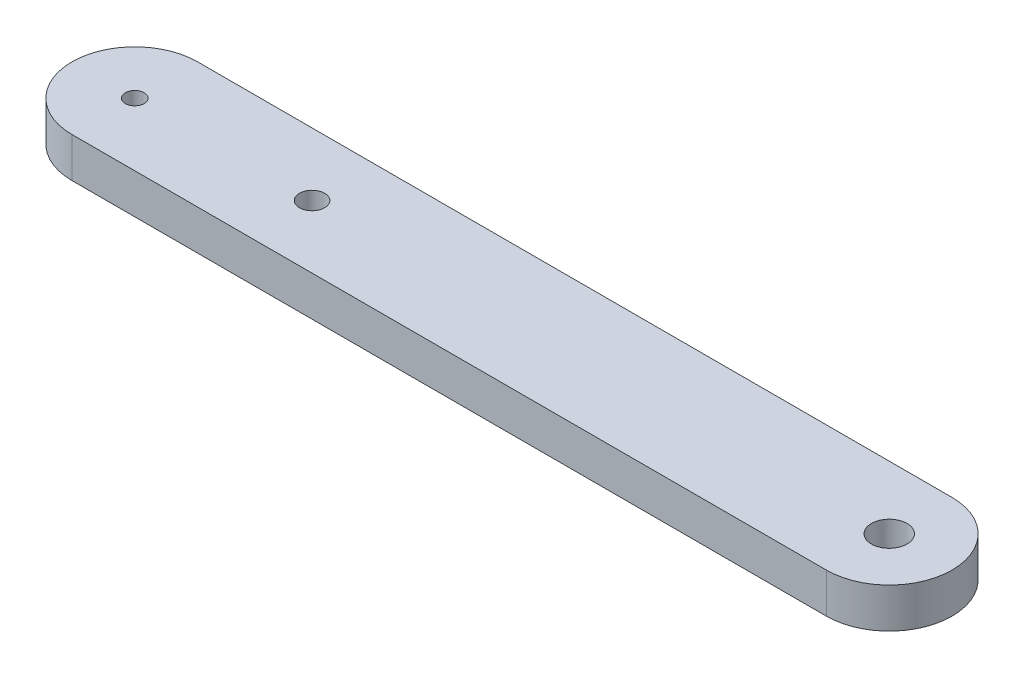
ISO-10303-21;
HEADER;
FILE_DESCRIPTION(('STEP AP214'),'2;1');
FILE_NAME('part.step','',(''),(''),'','','');
FILE_SCHEMA(('AUTOMOTIVE_DESIGN { 1 0 10303 214 1 1 1 1 }'));
ENDSEC;
DATA;
#1=APPLICATION_CONTEXT('core data for automotive mechanical design processes');
#2=APPLICATION_PROTOCOL_DEFINITION('international standard','automotive_design',2000,#1);
#3=PRODUCT_CONTEXT('',#1,'mechanical');
#4=PRODUCT('Part','Part','',(#3));
#5=PRODUCT_RELATED_PRODUCT_CATEGORY('part','',(#4));
#6=PRODUCT_DEFINITION_FORMATION('','',#4);
#7=PRODUCT_DEFINITION_CONTEXT('part definition',#1,'design');
#8=PRODUCT_DEFINITION('design','',#6,#7);
#9=PRODUCT_DEFINITION_SHAPE('','',#8);
#10=(LENGTH_UNIT() NAMED_UNIT(*) SI_UNIT(.MILLI.,.METRE.));
#11=(NAMED_UNIT(*) PLANE_ANGLE_UNIT() SI_UNIT($,.RADIAN.));
#12=(NAMED_UNIT(*) SI_UNIT($,.STERADIAN.) SOLID_ANGLE_UNIT());
#13=UNCERTAINTY_MEASURE_WITH_UNIT(LENGTH_MEASURE(1.E-05),#10,'distance_accuracy_value','');
#14=(GEOMETRIC_REPRESENTATION_CONTEXT(3) GLOBAL_UNCERTAINTY_ASSIGNED_CONTEXT((#13)) GLOBAL_UNIT_ASSIGNED_CONTEXT((#10,
#11,#12)) REPRESENTATION_CONTEXT('',''));
#15=CARTESIAN_POINT('',(0.,0.,0.));
#16=DIRECTION('',(0.,0.,1.));
#17=DIRECTION('',(1.,0.,0.));
#18=AXIS2_PLACEMENT_3D('',#15,#16,#17);
#19=CARTESIAN_POINT('',(30.,3.175,0.));
#20=DIRECTION('',(0.,-1.,0.));
#21=DIRECTION('',(0.,0.,-1.));
#22=AXIS2_PLACEMENT_3D('',#19,#20,#21);
#23=PLANE('',#22);
#24=CARTESIAN_POINT('',(-15.9,3.175,0.));
#25=DIRECTION('',(0.,1.,0.));
#26=DIRECTION('',(0.,0.,1.));
#27=AXIS2_PLACEMENT_3D('',#24,#25,#26);
#28=CIRCLE('',#27,1.);
#29=CARTESIAN_POINT('',(-15.9,3.175,1.));
#30=VERTEX_POINT('',#29);
#31=EDGE_CURVE('E124',#30,#30,#28,.T.);
#32=ORIENTED_EDGE('',*,*,#31,.F.);
#33=EDGE_LOOP('',(#32));
#34=FACE_BOUND('',#33,.T.);
#35=CARTESIAN_POINT('',(30.,3.175,0.));
#36=DIRECTION('',(0.,1.,0.));
#37=DIRECTION('',(0.,0.,-1.));
#38=AXIS2_PLACEMENT_3D('',#35,#36,#37);
#39=CIRCLE('',#38,5.);
#40=CARTESIAN_POINT('',(30.,3.175,5.));
#41=VERTEX_POINT('',#40);
#42=CARTESIAN_POINT('',(30.,3.175,-5.));
#43=VERTEX_POINT('',#42);
#44=EDGE_CURVE('E85',#41,#43,#39,.T.);
#45=ORIENTED_EDGE('',*,*,#44,.T.);
#46=DIRECTION('',(-1.,0.,0.));
#47=VECTOR('',#46,1.);
#48=CARTESIAN_POINT('',(-30.,3.175,-5.));
#49=LINE('',#48,#47);
#50=CARTESIAN_POINT('',(-30.,3.175,-5.));
#51=VERTEX_POINT('',#50);
#52=EDGE_CURVE('E80',#43,#51,#49,.T.);
#53=ORIENTED_EDGE('',*,*,#52,.T.);
#54=CARTESIAN_POINT('',(-30.,3.175,0.));
#55=DIRECTION('',(0.,1.,0.));
#56=DIRECTION('',(0.,0.,1.));
#57=AXIS2_PLACEMENT_3D('',#54,#55,#56);
#58=CIRCLE('',#57,5.);
#59=CARTESIAN_POINT('',(-30.,3.175,5.));
#60=VERTEX_POINT('',#59);
#61=EDGE_CURVE('E83',#51,#60,#58,.T.);
#62=ORIENTED_EDGE('',*,*,#61,.T.);
#63=DIRECTION('',(1.,0.,0.));
#64=VECTOR('',#63,1.);
#65=CARTESIAN_POINT('',(-30.,3.175,5.));
#66=LINE('',#65,#64);
#67=EDGE_CURVE('E50',#60,#41,#66,.T.);
#68=ORIENTED_EDGE('',*,*,#67,.T.);
#69=EDGE_LOOP('',(#45,#53,#62,#68));
#70=FACE_BOUND('',#69,.T.);
#71=CARTESIAN_POINT('',(-30.,3.175,0.));
#72=DIRECTION('',(0.,1.,0.));
#73=DIRECTION('',(0.,0.,1.));
#74=AXIS2_PLACEMENT_3D('',#71,#72,#73);
#75=CIRCLE('',#74,0.750000000000002);
#76=CARTESIAN_POINT('',(-30.,3.175,0.750000000000002));
#77=VERTEX_POINT('',#76);
#78=EDGE_CURVE('E100',#77,#77,#75,.T.);
#79=ORIENTED_EDGE('',*,*,#78,.F.);
#80=EDGE_LOOP('',(#79));
#81=FACE_BOUND('',#80,.T.);
#82=CARTESIAN_POINT('',(30.,3.175,0.));
#83=DIRECTION('',(0.,1.,0.));
#84=DIRECTION('',(0.,0.,1.));
#85=AXIS2_PLACEMENT_3D('',#82,#83,#84);
#86=CIRCLE('',#85,1.41999999999998);
#87=CARTESIAN_POINT('',(30.,3.175,1.41999999999998));
#88=VERTEX_POINT('',#87);
#89=EDGE_CURVE('E115',#88,#88,#86,.T.);
#90=ORIENTED_EDGE('',*,*,#89,.F.);
#91=EDGE_LOOP('',(#90));
#92=FACE_BOUND('',#91,.T.);
#93=ADVANCED_FACE('F33',(#34,#70,#81,#92),#23,.F.);
#94=CARTESIAN_POINT('',(30.,0.,0.));
#95=DIRECTION('',(0.,-1.,0.));
#96=DIRECTION('',(0.,0.,-1.));
#97=AXIS2_PLACEMENT_3D('',#94,#95,#96);
#98=PLANE('',#97);
#99=CARTESIAN_POINT('',(-15.9,0.,0.));
#100=DIRECTION('',(0.,1.,0.));
#101=DIRECTION('',(0.,0.,1.));
#102=AXIS2_PLACEMENT_3D('',#99,#100,#101);
#103=CIRCLE('',#102,1.);
#104=CARTESIAN_POINT('',(-15.9,0.,1.));
#105=VERTEX_POINT('',#104);
#106=EDGE_CURVE('E121',#105,#105,#103,.T.);
#107=ORIENTED_EDGE('',*,*,#106,.T.);
#108=EDGE_LOOP('',(#107));
#109=FACE_BOUND('',#108,.T.);
#110=CARTESIAN_POINT('',(-30.,0.,0.));
#111=DIRECTION('',(0.,1.,0.));
#112=DIRECTION('',(0.,0.,1.));
#113=AXIS2_PLACEMENT_3D('',#110,#111,#112);
#114=CIRCLE('',#113,0.750000000000002);
#115=CARTESIAN_POINT('',(-30.,0.,0.750000000000002));
#116=VERTEX_POINT('',#115);
#117=EDGE_CURVE('E112',#116,#116,#114,.T.);
#118=ORIENTED_EDGE('',*,*,#117,.T.);
#119=EDGE_LOOP('',(#118));
#120=FACE_BOUND('',#119,.T.);
#121=CARTESIAN_POINT('',(30.,0.,0.));
#122=DIRECTION('',(0.,1.,0.));
#123=DIRECTION('',(0.,0.,-1.));
#124=AXIS2_PLACEMENT_3D('',#121,#122,#123);
#125=CIRCLE('',#124,5.);
#126=CARTESIAN_POINT('',(30.,0.,5.));
#127=VERTEX_POINT('',#126);
#128=CARTESIAN_POINT('',(30.,0.,-5.));
#129=VERTEX_POINT('',#128);
#130=EDGE_CURVE('E97',#127,#129,#125,.T.);
#131=ORIENTED_EDGE('',*,*,#130,.F.);
#132=DIRECTION('',(1.,0.,0.));
#133=VECTOR('',#132,1.);
#134=CARTESIAN_POINT('',(-30.,0.,5.));
#135=LINE('',#134,#133);
#136=CARTESIAN_POINT('',(-30.,0.,5.));
#137=VERTEX_POINT('',#136);
#138=EDGE_CURVE('E73',#137,#127,#135,.T.);
#139=ORIENTED_EDGE('',*,*,#138,.F.);
#140=CARTESIAN_POINT('',(-30.,0.,0.));
#141=DIRECTION('',(0.,1.,0.));
#142=DIRECTION('',(0.,0.,1.));
#143=AXIS2_PLACEMENT_3D('',#140,#141,#142);
#144=CIRCLE('',#143,5.);
#145=CARTESIAN_POINT('',(-30.,0.,-5.));
#146=VERTEX_POINT('',#145);
#147=EDGE_CURVE('E67',#146,#137,#144,.T.);
#148=ORIENTED_EDGE('',*,*,#147,.F.);
#149=DIRECTION('',(-1.,0.,0.));
#150=VECTOR('',#149,1.);
#151=CARTESIAN_POINT('',(-30.,0.,-5.));
#152=LINE('',#151,#150);
#153=EDGE_CURVE('E89',#129,#146,#152,.T.);
#154=ORIENTED_EDGE('',*,*,#153,.F.);
#155=EDGE_LOOP('',(#131,#139,#148,#154));
#156=FACE_BOUND('',#155,.T.);
#157=CARTESIAN_POINT('',(30.,0.,0.));
#158=DIRECTION('',(0.,1.,0.));
#159=DIRECTION('',(0.,0.,1.));
#160=AXIS2_PLACEMENT_3D('',#157,#158,#159);
#161=CIRCLE('',#160,1.41999999999998);
#162=CARTESIAN_POINT('',(30.,0.,1.41999999999998));
#163=VERTEX_POINT('',#162);
#164=EDGE_CURVE('E118',#163,#163,#161,.T.);
#165=ORIENTED_EDGE('',*,*,#164,.T.);
#166=EDGE_LOOP('',(#165));
#167=FACE_BOUND('',#166,.T.);
#168=ADVANCED_FACE('F108',(#109,#120,#156,#167),#98,.T.);
#169=CARTESIAN_POINT('',(30.,3.175,0.));
#170=DIRECTION('',(0.,-1.,0.));
#171=DIRECTION('',(0.,0.,-1.));
#172=AXIS2_PLACEMENT_3D('',#169,#170,#171);
#173=CYLINDRICAL_SURFACE('',#172,5.);
#174=ORIENTED_EDGE('',*,*,#130,.T.);
#175=DIRECTION('',(0.,-1.,0.));
#176=VECTOR('',#175,1.);
#177=CARTESIAN_POINT('',(30.,3.175,-5.));
#178=LINE('',#177,#176);
#179=EDGE_CURVE('E11',#43,#129,#178,.T.);
#180=ORIENTED_EDGE('',*,*,#179,.F.);
#181=ORIENTED_EDGE('',*,*,#44,.F.);
#182=DIRECTION('',(0.,-1.,0.));
#183=VECTOR('',#182,1.);
#184=CARTESIAN_POINT('',(30.,3.175,5.));
#185=LINE('',#184,#183);
#186=EDGE_CURVE('E93',#41,#127,#185,.T.);
#187=ORIENTED_EDGE('',*,*,#186,.T.);
#188=EDGE_LOOP('',(#174,#180,#181,#187));
#189=FACE_BOUND('',#188,.T.);
#190=ADVANCED_FACE('F35',(#189),#173,.T.);
#191=CARTESIAN_POINT('',(-30.,3.175,-5.));
#192=DIRECTION('',(0.,0.,1.));
#193=DIRECTION('',(1.,0.,0.));
#194=AXIS2_PLACEMENT_3D('',#191,#192,#193);
#195=PLANE('',#194);
#196=ORIENTED_EDGE('',*,*,#153,.T.);
#197=DIRECTION('',(0.,-1.,0.));
#198=VECTOR('',#197,1.);
#199=CARTESIAN_POINT('',(-30.,3.175,-5.));
#200=LINE('',#199,#198);
#201=EDGE_CURVE('E42',#51,#146,#200,.T.);
#202=ORIENTED_EDGE('',*,*,#201,.F.);
#203=ORIENTED_EDGE('',*,*,#52,.F.);
#204=ORIENTED_EDGE('',*,*,#179,.T.);
#205=EDGE_LOOP('',(#196,#202,#203,#204));
#206=FACE_BOUND('',#205,.T.);
#207=ADVANCED_FACE('F88',(#206),#195,.F.);
#208=CARTESIAN_POINT('',(-30.,3.175,0.));
#209=DIRECTION('',(0.,-1.,0.));
#210=DIRECTION('',(0.,0.,-1.));
#211=AXIS2_PLACEMENT_3D('',#208,#209,#210);
#212=CYLINDRICAL_SURFACE('',#211,5.);
#213=ORIENTED_EDGE('',*,*,#147,.T.);
#214=DIRECTION('',(0.,-1.,0.));
#215=VECTOR('',#214,1.);
#216=CARTESIAN_POINT('',(-30.,3.175,5.));
#217=LINE('',#216,#215);
#218=EDGE_CURVE('E90',#60,#137,#217,.T.);
#219=ORIENTED_EDGE('',*,*,#218,.F.);
#220=ORIENTED_EDGE('',*,*,#61,.F.);
#221=ORIENTED_EDGE('',*,*,#201,.T.);
#222=EDGE_LOOP('',(#213,#219,#220,#221));
#223=FACE_BOUND('',#222,.T.);
#224=ADVANCED_FACE('F91',(#223),#212,.T.);
#225=CARTESIAN_POINT('',(-30.,3.175,5.));
#226=DIRECTION('',(0.,0.,-1.));
#227=DIRECTION('',(-1.,0.,0.));
#228=AXIS2_PLACEMENT_3D('',#225,#226,#227);
#229=PLANE('',#228);
#230=ORIENTED_EDGE('',*,*,#138,.T.);
#231=ORIENTED_EDGE('',*,*,#186,.F.);
#232=ORIENTED_EDGE('',*,*,#67,.F.);
#233=ORIENTED_EDGE('',*,*,#218,.T.);
#234=EDGE_LOOP('',(#230,#231,#232,#233));
#235=FACE_BOUND('',#234,.T.);
#236=ADVANCED_FACE('F105',(#235),#229,.F.);
#237=CARTESIAN_POINT('',(-30.,3.175,0.));
#238=DIRECTION('',(0.,-1.,0.));
#239=DIRECTION('',(0.,0.,-1.));
#240=AXIS2_PLACEMENT_3D('',#237,#238,#239);
#241=CYLINDRICAL_SURFACE('',#240,0.750000000000002);
#242=ORIENTED_EDGE('',*,*,#78,.T.);
#243=EDGE_LOOP('',(#242));
#244=FACE_BOUND('',#243,.T.);
#245=ORIENTED_EDGE('',*,*,#117,.F.);
#246=EDGE_LOOP('',(#245));
#247=FACE_BOUND('',#246,.T.);
#248=ADVANCED_FACE('F146',(#244,#247),#241,.F.);
#249=CARTESIAN_POINT('',(30.,3.175,0.));
#250=DIRECTION('',(0.,-1.,0.));
#251=DIRECTION('',(0.,0.,-1.));
#252=AXIS2_PLACEMENT_3D('',#249,#250,#251);
#253=CYLINDRICAL_SURFACE('',#252,1.41999999999998);
#254=ORIENTED_EDGE('',*,*,#89,.T.);
#255=EDGE_LOOP('',(#254));
#256=FACE_BOUND('',#255,.T.);
#257=ORIENTED_EDGE('',*,*,#164,.F.);
#258=EDGE_LOOP('',(#257));
#259=FACE_BOUND('',#258,.T.);
#260=ADVANCED_FACE('F135',(#256,#259),#253,.F.);
#261=CARTESIAN_POINT('',(-15.9,0.,0.));
#262=DIRECTION('',(0.,1.,0.));
#263=DIRECTION('',(0.,0.,1.));
#264=AXIS2_PLACEMENT_3D('',#261,#262,#263);
#265=CYLINDRICAL_SURFACE('',#264,1.);
#266=ORIENTED_EDGE('',*,*,#106,.F.);
#267=EDGE_LOOP('',(#266));
#268=FACE_BOUND('',#267,.T.);
#269=ORIENTED_EDGE('',*,*,#31,.T.);
#270=EDGE_LOOP('',(#269));
#271=FACE_BOUND('',#270,.T.);
#272=ADVANCED_FACE('F132',(#268,#271),#265,.F.);
#273=CLOSED_SHELL('',(#93,#168,#190,#207,#224,#236,#248,#260,#272));
#274=MANIFOLD_SOLID_BREP('B2',#273);
#275=ADVANCED_BREP_SHAPE_REPRESENTATION('',(#18,#274),#14);
#276=SHAPE_DEFINITION_REPRESENTATION(#9,#275);
ENDSEC;
END-ISO-10303-21;
